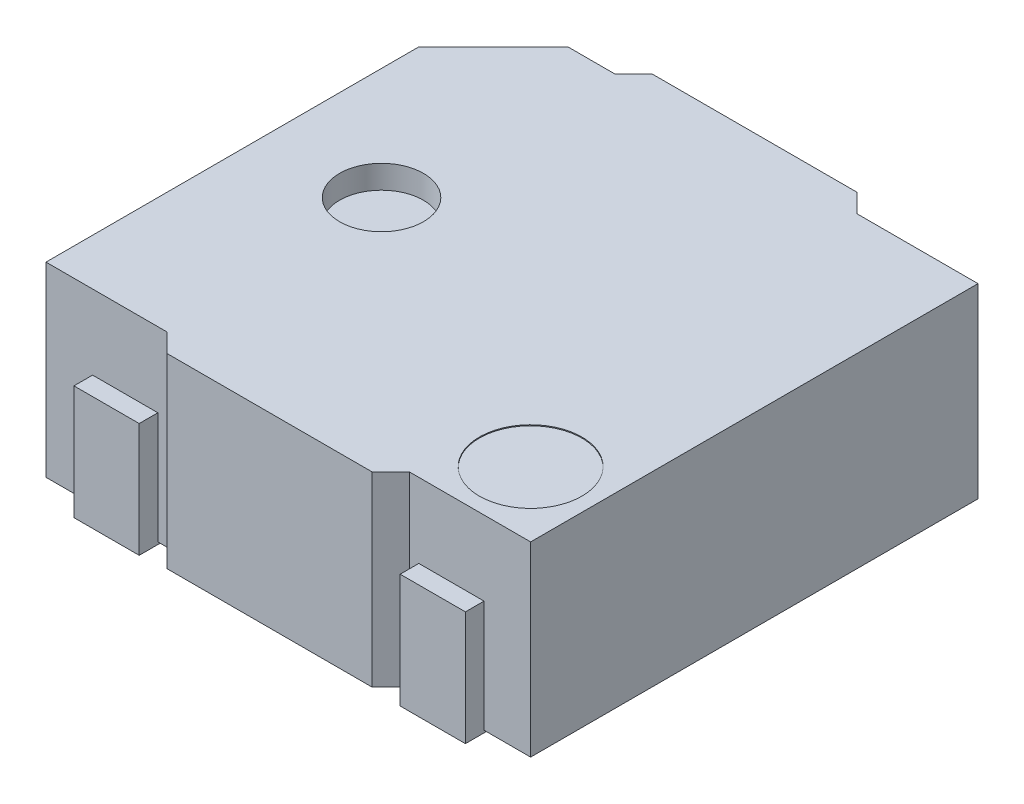
ISO-10303-21;
HEADER;
FILE_DESCRIPTION(('STEP AP214'),'2;1');
FILE_NAME('part.step','',(''),(''),'','','');
FILE_SCHEMA(('AUTOMOTIVE_DESIGN { 1 0 10303 214 1 1 1 1 }'));
ENDSEC;
DATA;
#1=APPLICATION_CONTEXT('core data for automotive mechanical design processes');
#2=APPLICATION_PROTOCOL_DEFINITION('international standard','automotive_design',2000,#1);
#3=PRODUCT_CONTEXT('',#1,'mechanical');
#4=PRODUCT('Part','Part','',(#3));
#5=PRODUCT_RELATED_PRODUCT_CATEGORY('part','',(#4));
#6=PRODUCT_DEFINITION_FORMATION('','',#4);
#7=PRODUCT_DEFINITION_CONTEXT('part definition',#1,'design');
#8=PRODUCT_DEFINITION('design','',#6,#7);
#9=PRODUCT_DEFINITION_SHAPE('','',#8);
#10=(LENGTH_UNIT() NAMED_UNIT(*) SI_UNIT(.MILLI.,.METRE.));
#11=(NAMED_UNIT(*) PLANE_ANGLE_UNIT() SI_UNIT($,.RADIAN.));
#12=(NAMED_UNIT(*) SI_UNIT($,.STERADIAN.) SOLID_ANGLE_UNIT());
#13=UNCERTAINTY_MEASURE_WITH_UNIT(LENGTH_MEASURE(1.E-05),#10,'distance_accuracy_value','');
#14=(GEOMETRIC_REPRESENTATION_CONTEXT(3) GLOBAL_UNCERTAINTY_ASSIGNED_CONTEXT((#13)) GLOBAL_UNIT_ASSIGNED_CONTEXT((#10,
#11,#12)) REPRESENTATION_CONTEXT('',''));
#15=CARTESIAN_POINT('',(0.,0.,0.));
#16=DIRECTION('',(0.,0.,1.));
#17=DIRECTION('',(1.,0.,0.));
#18=AXIS2_PLACEMENT_3D('',#15,#16,#17);
#19=CARTESIAN_POINT('',(2.6,2.025,2.60000000000001));
#20=DIRECTION('',(-1.,0.,0.));
#21=DIRECTION('',(0.,0.,1.));
#22=AXIS2_PLACEMENT_3D('',#19,#20,#21);
#23=PLANE('',#22);
#24=DIRECTION('',(0.,0.,-1.));
#25=VECTOR('',#24,1.);
#26=CARTESIAN_POINT('',(2.6,2.025,2.60000000000001));
#27=LINE('',#26,#25);
#28=CARTESIAN_POINT('',(2.6,2.025,2.40000000000001));
#29=VERTEX_POINT('',#28);
#30=CARTESIAN_POINT('',(2.6,2.025,-2.40000000000001));
#31=VERTEX_POINT('',#30);
#32=EDGE_CURVE('E441',#29,#31,#27,.T.);
#33=ORIENTED_EDGE('',*,*,#32,.F.);
#34=DIRECTION('',(0.,1.,0.));
#35=VECTOR('',#34,1.);
#36=CARTESIAN_POINT('',(2.6,0.0249999999999998,2.40000000000001));
#37=LINE('',#36,#35);
#38=CARTESIAN_POINT('',(2.6,0.0249999999999998,2.40000000000001));
#39=VERTEX_POINT('',#38);
#40=EDGE_CURVE('E362',#39,#29,#37,.T.);
#41=ORIENTED_EDGE('',*,*,#40,.F.);
#42=DIRECTION('',(0.,0.,-1.));
#43=VECTOR('',#42,1.);
#44=CARTESIAN_POINT('',(2.6,0.025,2.60000000000001));
#45=LINE('',#44,#43);
#46=CARTESIAN_POINT('',(2.6,0.0249999999999998,-2.40000000000001));
#47=VERTEX_POINT('',#46);
#48=EDGE_CURVE('E440',#39,#47,#45,.T.);
#49=ORIENTED_EDGE('',*,*,#48,.T.);
#50=DIRECTION('',(0.,1.,0.));
#51=VECTOR('',#50,1.);
#52=CARTESIAN_POINT('',(2.6,0.0249999999999998,-2.40000000000001));
#53=LINE('',#52,#51);
#54=EDGE_CURVE('E367',#47,#31,#53,.T.);
#55=ORIENTED_EDGE('',*,*,#54,.T.);
#56=EDGE_LOOP('',(#33,#41,#49,#55));
#57=FACE_BOUND('',#56,.T.);
#58=ADVANCED_FACE('F35',(#57),#23,.F.);
#59=CARTESIAN_POINT('',(-2.6,2.025,-2.60000000000002));
#60=DIRECTION('',(0.,0.,1.));
#61=DIRECTION('',(1.,0.,0.));
#62=AXIS2_PLACEMENT_3D('',#59,#60,#61);
#63=PLANE('',#62);
#64=DIRECTION('',(-1.,0.,0.));
#65=VECTOR('',#64,1.);
#66=CARTESIAN_POINT('',(-2.6,2.025,-2.60000000000002));
#67=LINE('',#66,#65);
#68=CARTESIAN_POINT('',(1.1,2.025,-2.60000000000001));
#69=VERTEX_POINT('',#68);
#70=CARTESIAN_POINT('',(-1.1,2.025,-2.60000000000001));
#71=VERTEX_POINT('',#70);
#72=EDGE_CURVE('E444',#69,#71,#67,.T.);
#73=ORIENTED_EDGE('',*,*,#72,.F.);
#74=DIRECTION('',(0.,1.,0.));
#75=VECTOR('',#74,1.);
#76=CARTESIAN_POINT('',(1.1,0.0249999999999998,-2.60000000000001));
#77=LINE('',#76,#75);
#78=CARTESIAN_POINT('',(1.1,0.0249999999999998,-2.60000000000001));
#79=VERTEX_POINT('',#78);
#80=EDGE_CURVE('E414',#79,#69,#77,.T.);
#81=ORIENTED_EDGE('',*,*,#80,.F.);
#82=DIRECTION('',(-1.,0.,0.));
#83=VECTOR('',#82,1.);
#84=CARTESIAN_POINT('',(-2.6,0.025,-2.60000000000002));
#85=LINE('',#84,#83);
#86=CARTESIAN_POINT('',(-1.1,0.0249999999999998,-2.60000000000001));
#87=VERTEX_POINT('',#86);
#88=EDGE_CURVE('E457',#79,#87,#85,.T.);
#89=ORIENTED_EDGE('',*,*,#88,.T.);
#90=DIRECTION('',(0.,1.,0.));
#91=VECTOR('',#90,1.);
#92=CARTESIAN_POINT('',(-1.1,0.0249999999999998,-2.60000000000001));
#93=LINE('',#92,#91);
#94=EDGE_CURVE('E416',#87,#71,#93,.T.);
#95=ORIENTED_EDGE('',*,*,#94,.T.);
#96=EDGE_LOOP('',(#73,#81,#89,#95));
#97=FACE_BOUND('',#96,.T.);
#98=ADVANCED_FACE('F508',(#97),#63,.F.);
#99=CARTESIAN_POINT('',(-2.6,2.025,2.60000000000001));
#100=DIRECTION('',(1.,0.,0.));
#101=DIRECTION('',(0.,0.,-1.));
#102=AXIS2_PLACEMENT_3D('',#99,#100,#101);
#103=PLANE('',#102);
#104=DIRECTION('',(0.,0.,1.));
#105=VECTOR('',#104,1.);
#106=CARTESIAN_POINT('',(-2.6,0.025,2.60000000000001));
#107=LINE('',#106,#105);
#108=CARTESIAN_POINT('',(-2.6,0.0249999999999998,-1.60000000000002));
#109=VERTEX_POINT('',#108);
#110=CARTESIAN_POINT('',(-2.6,0.0249999999999998,2.40000000000001));
#111=VERTEX_POINT('',#110);
#112=EDGE_CURVE('E460',#109,#111,#107,.T.);
#113=ORIENTED_EDGE('',*,*,#112,.T.);
#114=DIRECTION('',(0.,1.,0.));
#115=VECTOR('',#114,1.);
#116=CARTESIAN_POINT('',(-2.6,0.0249999999999998,2.40000000000001));
#117=LINE('',#116,#115);
#118=CARTESIAN_POINT('',(-2.6,2.025,2.40000000000001));
#119=VERTEX_POINT('',#118);
#120=EDGE_CURVE('E374',#111,#119,#117,.T.);
#121=ORIENTED_EDGE('',*,*,#120,.T.);
#122=DIRECTION('',(0.,0.,1.));
#123=VECTOR('',#122,1.);
#124=CARTESIAN_POINT('',(-2.6,2.025,2.60000000000001));
#125=LINE('',#124,#123);
#126=CARTESIAN_POINT('',(-2.6,2.025,-1.60000000000002));
#127=VERTEX_POINT('',#126);
#128=EDGE_CURVE('E448',#127,#119,#125,.T.);
#129=ORIENTED_EDGE('',*,*,#128,.F.);
#130=DIRECTION('',(0.,1.,0.));
#131=VECTOR('',#130,1.);
#132=CARTESIAN_POINT('',(-2.6,0.0249999999999998,-1.60000000000002));
#133=LINE('',#132,#131);
#134=EDGE_CURVE('E436',#109,#127,#133,.T.);
#135=ORIENTED_EDGE('',*,*,#134,.F.);
#136=EDGE_LOOP('',(#113,#121,#129,#135));
#137=FACE_BOUND('',#136,.T.);
#138=ADVANCED_FACE('F545',(#137),#103,.F.);
#139=CARTESIAN_POINT('',(-2.6,2.025,2.60000000000001));
#140=DIRECTION('',(0.,0.,-1.));
#141=DIRECTION('',(-1.,0.,0.));
#142=AXIS2_PLACEMENT_3D('',#139,#140,#141);
#143=PLANE('',#142);
#144=DIRECTION('',(1.,0.,0.));
#145=VECTOR('',#144,1.);
#146=CARTESIAN_POINT('',(-2.6,2.025,2.60000000000001));
#147=LINE('',#146,#145);
#148=CARTESIAN_POINT('',(-1.1,2.025,2.60000000000001));
#149=VERTEX_POINT('',#148);
#150=CARTESIAN_POINT('',(1.1,2.025,2.60000000000001));
#151=VERTEX_POINT('',#150);
#152=EDGE_CURVE('E451',#149,#151,#147,.T.);
#153=ORIENTED_EDGE('',*,*,#152,.F.);
#154=DIRECTION('',(0.,1.,0.));
#155=VECTOR('',#154,1.);
#156=CARTESIAN_POINT('',(-1.1,0.0249999999999998,2.60000000000001));
#157=LINE('',#156,#155);
#158=CARTESIAN_POINT('',(-1.1,0.0249999999999998,2.60000000000001));
#159=VERTEX_POINT('',#158);
#160=EDGE_CURVE('E380',#159,#149,#157,.T.);
#161=ORIENTED_EDGE('',*,*,#160,.F.);
#162=DIRECTION('',(1.,0.,0.));
#163=VECTOR('',#162,1.);
#164=CARTESIAN_POINT('',(-2.6,0.025,2.60000000000001));
#165=LINE('',#164,#163);
#166=CARTESIAN_POINT('',(1.1,0.0249999999999998,2.60000000000001));
#167=VERTEX_POINT('',#166);
#168=EDGE_CURVE('E445',#159,#167,#165,.T.);
#169=ORIENTED_EDGE('',*,*,#168,.T.);
#170=DIRECTION('',(0.,1.,0.));
#171=VECTOR('',#170,1.);
#172=CARTESIAN_POINT('',(1.1,0.0249999999999998,2.60000000000001));
#173=LINE('',#172,#171);
#174=EDGE_CURVE('E382',#167,#151,#173,.T.);
#175=ORIENTED_EDGE('',*,*,#174,.T.);
#176=EDGE_LOOP('',(#153,#161,#169,#175));
#177=FACE_BOUND('',#176,.T.);
#178=ADVANCED_FACE('F549',(#177),#143,.F.);
#179=CARTESIAN_POINT('',(0.,2.025,0.));
#180=DIRECTION('',(0.,-1.,0.));
#181=DIRECTION('',(0.,0.,-1.));
#182=AXIS2_PLACEMENT_3D('',#179,#180,#181);
#183=PLANE('',#182);
#184=CARTESIAN_POINT('',(1.90000000000001,2.025,1.70000000000001));
#185=DIRECTION('',(0.,1.,0.));
#186=DIRECTION('',(0.,0.,1.));
#187=AXIS2_PLACEMENT_3D('',#184,#185,#186);
#188=CIRCLE('',#187,0.550000000000001);
#189=CARTESIAN_POINT('',(1.90000000000001,2.025,2.25000000000001));
#190=VERTEX_POINT('',#189);
#191=EDGE_CURVE('E262',#190,#190,#188,.T.);
#192=ORIENTED_EDGE('',*,*,#191,.F.);
#193=EDGE_LOOP('',(#192));
#194=FACE_BOUND('',#193,.T.);
#195=CARTESIAN_POINT('',(-1.4,2.025,0.));
#196=DIRECTION('',(0.,1.,0.));
#197=DIRECTION('',(0.,0.,1.));
#198=AXIS2_PLACEMENT_3D('',#195,#196,#197);
#199=CIRCLE('',#198,0.45);
#200=CARTESIAN_POINT('',(-1.4,2.025,0.45));
#201=VERTEX_POINT('',#200);
#202=EDGE_CURVE('E429',#201,#201,#199,.T.);
#203=ORIENTED_EDGE('',*,*,#202,.F.);
#204=EDGE_LOOP('',(#203));
#205=FACE_BOUND('',#204,.T.);
#206=ORIENTED_EDGE('',*,*,#128,.T.);
#207=DIRECTION('',(-1.,0.,0.));
#208=VECTOR('',#207,1.);
#209=CARTESIAN_POINT('',(-2.6,2.025,2.40000000000001));
#210=LINE('',#209,#208);
#211=CARTESIAN_POINT('',(-1.3,2.025,2.40000000000001));
#212=VERTEX_POINT('',#211);
#213=EDGE_CURVE('E372',#212,#119,#210,.T.);
#214=ORIENTED_EDGE('',*,*,#213,.F.);
#215=DIRECTION('',(-0.707106781186546,0.,-0.707106781186549));
#216=VECTOR('',#215,1.);
#217=CARTESIAN_POINT('',(-1.3,2.025,2.40000000000001));
#218=LINE('',#217,#216);
#219=EDGE_CURVE('E369',#149,#212,#218,.T.);
#220=ORIENTED_EDGE('',*,*,#219,.F.);
#221=ORIENTED_EDGE('',*,*,#152,.T.);
#222=DIRECTION('',(-0.707106781186548,0.,0.707106781186547));
#223=VECTOR('',#222,1.);
#224=CARTESIAN_POINT('',(1.1,2.025,2.60000000000001));
#225=LINE('',#224,#223);
#226=CARTESIAN_POINT('',(1.3,2.025,2.40000000000001));
#227=VERTEX_POINT('',#226);
#228=EDGE_CURVE('E366',#227,#151,#225,.T.);
#229=ORIENTED_EDGE('',*,*,#228,.F.);
#230=DIRECTION('',(-1.,0.,0.));
#231=VECTOR('',#230,1.);
#232=CARTESIAN_POINT('',(1.3,2.025,2.40000000000001));
#233=LINE('',#232,#231);
#234=EDGE_CURVE('E363',#29,#227,#233,.T.);
#235=ORIENTED_EDGE('',*,*,#234,.F.);
#236=ORIENTED_EDGE('',*,*,#32,.T.);
#237=DIRECTION('',(1.,0.,0.));
#238=VECTOR('',#237,1.);
#239=CARTESIAN_POINT('',(1.3,2.025,-2.40000000000001));
#240=LINE('',#239,#238);
#241=CARTESIAN_POINT('',(1.3,2.025,-2.40000000000001));
#242=VERTEX_POINT('',#241);
#243=EDGE_CURVE('E392',#242,#31,#240,.T.);
#244=ORIENTED_EDGE('',*,*,#243,.F.);
#245=DIRECTION('',(0.707106781186548,0.,0.707106781186547));
#246=VECTOR('',#245,1.);
#247=CARTESIAN_POINT('',(1.1,2.025,-2.60000000000001));
#248=LINE('',#247,#246);
#249=EDGE_CURVE('E406',#69,#242,#248,.T.);
#250=ORIENTED_EDGE('',*,*,#249,.F.);
#251=ORIENTED_EDGE('',*,*,#72,.T.);
#252=DIRECTION('',(0.707106781186546,0.,-0.707106781186549));
#253=VECTOR('',#252,1.);
#254=CARTESIAN_POINT('',(-1.3,2.025,-2.40000000000001));
#255=LINE('',#254,#253);
#256=CARTESIAN_POINT('',(-1.3,2.025,-2.40000000000001));
#257=VERTEX_POINT('',#256);
#258=EDGE_CURVE('E404',#257,#71,#255,.T.);
#259=ORIENTED_EDGE('',*,*,#258,.F.);
#260=DIRECTION('',(1.,0.,0.));
#261=VECTOR('',#260,1.);
#262=CARTESIAN_POINT('',(-2.6,2.025,-2.40000000000001));
#263=LINE('',#262,#261);
#264=CARTESIAN_POINT('',(-1.80000000000001,2.025,-2.40000000000001));
#265=VERTEX_POINT('',#264);
#266=EDGE_CURVE('E347',#265,#257,#263,.T.);
#267=ORIENTED_EDGE('',*,*,#266,.F.);
#268=DIRECTION('',(0.707106781186549,0.,-0.707106781186546));
#269=VECTOR('',#268,1.);
#270=CARTESIAN_POINT('',(-2.6,2.025,-1.60000000000002));
#271=LINE('',#270,#269);
#272=EDGE_CURVE('E432',#127,#265,#271,.T.);
#273=ORIENTED_EDGE('',*,*,#272,.F.);
#274=EDGE_LOOP('',(#206,#214,#220,#221,#229,#235,#236,#244,#250,#251,#259,#267,#273));
#275=FACE_BOUND('',#274,.T.);
#276=ADVANCED_FACE('F511',(#194,#205,#275),#183,.F.);
#277=CARTESIAN_POINT('',(0.,0.025,0.));
#278=DIRECTION('',(0.,-1.,0.));
#279=DIRECTION('',(0.,0.,-1.));
#280=AXIS2_PLACEMENT_3D('',#277,#278,#279);
#281=PLANE('',#280);
#282=DIRECTION('',(0.,0.,-1.));
#283=VECTOR('',#282,1.);
#284=CARTESIAN_POINT('',(1.4,0.025,0.));
#285=LINE('',#284,#283);
#286=CARTESIAN_POINT('',(1.4,0.0250000000000001,-1.70000000000001));
#287=VERTEX_POINT('',#286);
#288=CARTESIAN_POINT('',(1.4,0.0249999999999998,-2.40000000000001));
#289=VERTEX_POINT('',#288);
#290=EDGE_CURVE('E280',#287,#289,#285,.T.);
#291=ORIENTED_EDGE('',*,*,#290,.F.);
#292=DIRECTION('',(-1.,0.,0.));
#293=VECTOR('',#292,1.);
#294=CARTESIAN_POINT('',(0.,0.025,-1.70000000000001));
#295=LINE('',#294,#293);
#296=CARTESIAN_POINT('',(2.1,0.0250000000000001,-1.70000000000001));
#297=VERTEX_POINT('',#296);
#298=EDGE_CURVE('E11',#297,#287,#295,.T.);
#299=ORIENTED_EDGE('',*,*,#298,.F.);
#300=DIRECTION('',(0.,0.,1.));
#301=VECTOR('',#300,1.);
#302=CARTESIAN_POINT('',(2.1,0.025,0.));
#303=LINE('',#302,#301);
#304=CARTESIAN_POINT('',(2.1,0.0249999999999998,-2.40000000000001));
#305=VERTEX_POINT('',#304);
#306=EDGE_CURVE('E275',#305,#297,#303,.T.);
#307=ORIENTED_EDGE('',*,*,#306,.F.);
#308=DIRECTION('',(1.,0.,0.));
#309=VECTOR('',#308,1.);
#310=CARTESIAN_POINT('',(1.3,0.0249999999999998,-2.40000000000001));
#311=LINE('',#310,#309);
#312=EDGE_CURVE('E398',#305,#47,#311,.T.);
#313=ORIENTED_EDGE('',*,*,#312,.T.);
#314=ORIENTED_EDGE('',*,*,#48,.F.);
#315=DIRECTION('',(-1.,0.,0.));
#316=VECTOR('',#315,1.);
#317=CARTESIAN_POINT('',(1.3,0.0249999999999998,2.40000000000001));
#318=LINE('',#317,#316);
#319=CARTESIAN_POINT('',(2.1,0.0249999999999998,2.40000000000001));
#320=VERTEX_POINT('',#319);
#321=EDGE_CURVE('E348',#39,#320,#318,.T.);
#322=ORIENTED_EDGE('',*,*,#321,.T.);
#323=DIRECTION('',(0.,0.,1.));
#324=VECTOR('',#323,1.);
#325=CARTESIAN_POINT('',(2.1,0.025,0.));
#326=LINE('',#325,#324);
#327=CARTESIAN_POINT('',(2.1,0.025,1.70000000000001));
#328=VERTEX_POINT('',#327);
#329=EDGE_CURVE('E336',#328,#320,#326,.T.);
#330=ORIENTED_EDGE('',*,*,#329,.F.);
#331=DIRECTION('',(1.,0.,0.));
#332=VECTOR('',#331,1.);
#333=CARTESIAN_POINT('',(0.,0.025,1.70000000000001));
#334=LINE('',#333,#332);
#335=CARTESIAN_POINT('',(1.4,0.025,1.70000000000001));
#336=VERTEX_POINT('',#335);
#337=EDGE_CURVE('E474',#336,#328,#334,.T.);
#338=ORIENTED_EDGE('',*,*,#337,.F.);
#339=DIRECTION('',(0.,0.,-1.));
#340=VECTOR('',#339,1.);
#341=CARTESIAN_POINT('',(1.4,0.025,0.));
#342=LINE('',#341,#340);
#343=CARTESIAN_POINT('',(1.4,0.0249999999999998,2.40000000000001));
#344=VERTEX_POINT('',#343);
#345=EDGE_CURVE('E344',#344,#336,#342,.T.);
#346=ORIENTED_EDGE('',*,*,#345,.F.);
#347=CARTESIAN_POINT('',(1.3,0.025,2.40000000000001));
#348=VERTEX_POINT('',#347);
#349=EDGE_CURVE('E352',#344,#348,#318,.T.);
#350=ORIENTED_EDGE('',*,*,#349,.T.);
#351=DIRECTION('',(-0.707106781186548,0.,0.707106781186547));
#352=VECTOR('',#351,1.);
#353=CARTESIAN_POINT('',(1.1,0.0249999999999998,2.60000000000001));
#354=LINE('',#353,#352);
#355=EDGE_CURVE('E351',#348,#167,#354,.T.);
#356=ORIENTED_EDGE('',*,*,#355,.T.);
#357=ORIENTED_EDGE('',*,*,#168,.F.);
#358=DIRECTION('',(-0.707106781186546,0.,-0.707106781186549));
#359=VECTOR('',#358,1.);
#360=CARTESIAN_POINT('',(-1.3,0.0249999999999998,2.40000000000001));
#361=LINE('',#360,#359);
#362=CARTESIAN_POINT('',(-1.3,0.025,2.40000000000001));
#363=VERTEX_POINT('',#362);
#364=EDGE_CURVE('E355',#159,#363,#361,.T.);
#365=ORIENTED_EDGE('',*,*,#364,.T.);
#366=DIRECTION('',(-1.,0.,0.));
#367=VECTOR('',#366,1.);
#368=CARTESIAN_POINT('',(-2.6,0.0249999999999998,2.40000000000001));
#369=LINE('',#368,#367);
#370=CARTESIAN_POINT('',(-1.4,0.0249999999999998,2.40000000000001));
#371=VERTEX_POINT('',#370);
#372=EDGE_CURVE('E359',#363,#371,#369,.T.);
#373=ORIENTED_EDGE('',*,*,#372,.T.);
#374=DIRECTION('',(0.,0.,1.));
#375=VECTOR('',#374,1.);
#376=CARTESIAN_POINT('',(-1.4,0.025,0.));
#377=LINE('',#376,#375);
#378=CARTESIAN_POINT('',(-1.4,0.0250000000000001,1.70000000000001));
#379=VERTEX_POINT('',#378);
#380=EDGE_CURVE('E311',#379,#371,#377,.T.);
#381=ORIENTED_EDGE('',*,*,#380,.F.);
#382=DIRECTION('',(1.,0.,0.));
#383=VECTOR('',#382,1.);
#384=CARTESIAN_POINT('',(0.,0.025,1.70000000000001));
#385=LINE('',#384,#383);
#386=CARTESIAN_POINT('',(-2.1,0.0250000000000001,1.70000000000001));
#387=VERTEX_POINT('',#386);
#388=EDGE_CURVE('E486',#387,#379,#385,.T.);
#389=ORIENTED_EDGE('',*,*,#388,.F.);
#390=DIRECTION('',(0.,0.,-1.));
#391=VECTOR('',#390,1.);
#392=CARTESIAN_POINT('',(-2.1,0.025,0.));
#393=LINE('',#392,#391);
#394=CARTESIAN_POINT('',(-2.1,0.0249999999999998,2.40000000000001));
#395=VERTEX_POINT('',#394);
#396=EDGE_CURVE('E304',#395,#387,#393,.T.);
#397=ORIENTED_EDGE('',*,*,#396,.F.);
#398=EDGE_CURVE('E358',#395,#111,#369,.T.);
#399=ORIENTED_EDGE('',*,*,#398,.T.);
#400=ORIENTED_EDGE('',*,*,#112,.F.);
#401=DIRECTION('',(0.707106781186549,0.,-0.707106781186546));
#402=VECTOR('',#401,1.);
#403=CARTESIAN_POINT('',(-2.6,0.0249999999999998,-1.60000000000002));
#404=LINE('',#403,#402);
#405=CARTESIAN_POINT('',(-1.80000000000001,0.0249999999999998,-2.40000000000001));
#406=VERTEX_POINT('',#405);
#407=EDGE_CURVE('E433',#109,#406,#404,.T.);
#408=ORIENTED_EDGE('',*,*,#407,.T.);
#409=DIRECTION('',(1.,0.,0.));
#410=VECTOR('',#409,1.);
#411=CARTESIAN_POINT('',(-2.6,0.0249999999999998,-2.40000000000001));
#412=LINE('',#411,#410);
#413=CARTESIAN_POINT('',(-1.3,0.0249999999999998,-2.40000000000001));
#414=VERTEX_POINT('',#413);
#415=EDGE_CURVE('E388',#406,#414,#412,.T.);
#416=ORIENTED_EDGE('',*,*,#415,.T.);
#417=DIRECTION('',(0.707106781186546,0.,-0.707106781186549));
#418=VECTOR('',#417,1.);
#419=CARTESIAN_POINT('',(-1.3,0.0249999999999998,-2.40000000000001));
#420=LINE('',#419,#418);
#421=EDGE_CURVE('E391',#414,#87,#420,.T.);
#422=ORIENTED_EDGE('',*,*,#421,.T.);
#423=ORIENTED_EDGE('',*,*,#88,.F.);
#424=DIRECTION('',(0.707106781186548,0.,0.707106781186547));
#425=VECTOR('',#424,1.);
#426=CARTESIAN_POINT('',(1.1,0.0249999999999998,-2.60000000000001));
#427=LINE('',#426,#425);
#428=CARTESIAN_POINT('',(1.3,0.025,-2.40000000000001));
#429=VERTEX_POINT('',#428);
#430=EDGE_CURVE('E395',#79,#429,#427,.T.);
#431=ORIENTED_EDGE('',*,*,#430,.T.);
#432=EDGE_CURVE('E399',#429,#289,#311,.T.);
#433=ORIENTED_EDGE('',*,*,#432,.T.);
#434=EDGE_LOOP('',(#291,#299,#307,#313,#314,#322,#330,#338,#346,#350,#356,#357,#365,#373,#381,
#389,#397,#399,#400,#408,#416,#422,#423,#431,#433));
#435=FACE_BOUND('',#434,.T.);
#436=ADVANCED_FACE('F499',(#435),#281,.T.);
#437=CARTESIAN_POINT('',(-2.6,0.0249999999999998,-1.60000000000002));
#438=DIRECTION('',(0.707106781186546,0.,0.707106781186549));
#439=DIRECTION('',(0.707106781186549,0.,-0.707106781186546));
#440=AXIS2_PLACEMENT_3D('',#437,#438,#439);
#441=PLANE('',#440);
#442=ORIENTED_EDGE('',*,*,#272,.T.);
#443=DIRECTION('',(0.,-1.,0.));
#444=VECTOR('',#443,1.);
#445=CARTESIAN_POINT('',(-1.80000000000001,0.0249999999999998,-2.40000000000001));
#446=LINE('',#445,#444);
#447=EDGE_CURVE('E454',#265,#406,#446,.T.);
#448=ORIENTED_EDGE('',*,*,#447,.T.);
#449=ORIENTED_EDGE('',*,*,#407,.F.);
#450=ORIENTED_EDGE('',*,*,#134,.T.);
#451=EDGE_LOOP('',(#442,#448,#449,#450));
#452=FACE_BOUND('',#451,.T.);
#453=ADVANCED_FACE('F558',(#452),#441,.F.);
#454=CARTESIAN_POINT('',(-1.4,1.775,0.));
#455=DIRECTION('',(0.,1.,0.));
#456=DIRECTION('',(0.,0.,1.));
#457=AXIS2_PLACEMENT_3D('',#454,#455,#456);
#458=CYLINDRICAL_SURFACE('',#457,0.45);
#459=CARTESIAN_POINT('',(-1.4,1.775,0.));
#460=DIRECTION('',(0.,1.,0.));
#461=DIRECTION('',(0.,0.,1.));
#462=AXIS2_PLACEMENT_3D('',#459,#460,#461);
#463=CIRCLE('',#462,0.45);
#464=CARTESIAN_POINT('',(-1.4,1.775,0.45));
#465=VERTEX_POINT('',#464);
#466=EDGE_CURVE('E424',#465,#465,#463,.T.);
#467=ORIENTED_EDGE('',*,*,#466,.F.);
#468=EDGE_LOOP('',(#467));
#469=FACE_BOUND('',#468,.T.);
#470=ORIENTED_EDGE('',*,*,#202,.T.);
#471=EDGE_LOOP('',(#470));
#472=FACE_BOUND('',#471,.T.);
#473=ADVANCED_FACE('F564',(#469,#472),#458,.F.);
#474=CARTESIAN_POINT('',(-1.4,1.575,0.));
#475=DIRECTION('',(0.,1.,0.));
#476=DIRECTION('',(0.,0.,1.));
#477=AXIS2_PLACEMENT_3D('',#474,#475,#476);
#478=CYLINDRICAL_SURFACE('',#477,0.8);
#479=CARTESIAN_POINT('',(-1.4,1.575,0.));
#480=DIRECTION('',(0.,1.,0.));
#481=DIRECTION('',(0.,0.,1.));
#482=AXIS2_PLACEMENT_3D('',#479,#480,#481);
#483=CIRCLE('',#482,0.8);
#484=CARTESIAN_POINT('',(-1.4,1.575,0.8));
#485=VERTEX_POINT('',#484);
#486=EDGE_CURVE('E421',#485,#485,#483,.T.);
#487=ORIENTED_EDGE('',*,*,#486,.F.);
#488=EDGE_LOOP('',(#487));
#489=FACE_BOUND('',#488,.T.);
#490=CARTESIAN_POINT('',(-1.4,1.775,0.));
#491=DIRECTION('',(0.,1.,0.));
#492=DIRECTION('',(0.,0.,1.));
#493=AXIS2_PLACEMENT_3D('',#490,#491,#492);
#494=CIRCLE('',#493,0.8);
#495=CARTESIAN_POINT('',(-1.4,1.775,0.8));
#496=VERTEX_POINT('',#495);
#497=EDGE_CURVE('E377',#496,#496,#494,.T.);
#498=ORIENTED_EDGE('',*,*,#497,.T.);
#499=EDGE_LOOP('',(#498));
#500=FACE_BOUND('',#499,.T.);
#501=ADVANCED_FACE('F568',(#489,#500),#478,.F.);
#502=CARTESIAN_POINT('',(-1.4,1.575,0.));
#503=DIRECTION('',(0.,1.,0.));
#504=DIRECTION('',(0.,0.,1.));
#505=AXIS2_PLACEMENT_3D('',#502,#503,#504);
#506=PLANE('',#505);
#507=ORIENTED_EDGE('',*,*,#486,.T.);
#508=EDGE_LOOP('',(#507));
#509=FACE_BOUND('',#508,.T.);
#510=ADVANCED_FACE('F572',(#509),#506,.T.);
#511=CARTESIAN_POINT('',(-1.4,1.775,0.));
#512=DIRECTION('',(0.,1.,0.));
#513=DIRECTION('',(0.,0.,1.));
#514=AXIS2_PLACEMENT_3D('',#511,#512,#513);
#515=PLANE('',#514);
#516=ORIENTED_EDGE('',*,*,#466,.T.);
#517=EDGE_LOOP('',(#516));
#518=FACE_BOUND('',#517,.T.);
#519=ORIENTED_EDGE('',*,*,#497,.F.);
#520=EDGE_LOOP('',(#519));
#521=FACE_BOUND('',#520,.T.);
#522=ADVANCED_FACE('F574',(#518,#521),#515,.F.);
#523=CARTESIAN_POINT('',(-2.6,0.0249999999999998,-2.40000000000001));
#524=DIRECTION('',(0.,0.,1.));
#525=DIRECTION('',(1.,0.,0.));
#526=AXIS2_PLACEMENT_3D('',#523,#524,#525);
#527=PLANE('',#526);
#528=ORIENTED_EDGE('',*,*,#266,.T.);
#529=DIRECTION('',(0.,1.,0.));
#530=VECTOR('',#529,1.);
#531=CARTESIAN_POINT('',(-1.3,0.0249999999999998,-2.40000000000001));
#532=LINE('',#531,#530);
#533=EDGE_CURVE('E402',#414,#257,#532,.T.);
#534=ORIENTED_EDGE('',*,*,#533,.F.);
#535=ORIENTED_EDGE('',*,*,#415,.F.);
#536=ORIENTED_EDGE('',*,*,#447,.F.);
#537=EDGE_LOOP('',(#528,#534,#535,#536));
#538=FACE_BOUND('',#537,.T.);
#539=ADVANCED_FACE('F577',(#538),#527,.F.);
#540=CARTESIAN_POINT('',(-1.3,0.0249999999999998,-2.40000000000001));
#541=DIRECTION('',(0.707106781186549,0.,0.707106781186546));
#542=DIRECTION('',(0.707106781186546,0.,-0.707106781186549));
#543=AXIS2_PLACEMENT_3D('',#540,#541,#542);
#544=PLANE('',#543);
#545=ORIENTED_EDGE('',*,*,#258,.T.);
#546=ORIENTED_EDGE('',*,*,#94,.F.);
#547=ORIENTED_EDGE('',*,*,#421,.F.);
#548=ORIENTED_EDGE('',*,*,#533,.T.);
#549=EDGE_LOOP('',(#545,#546,#547,#548));
#550=FACE_BOUND('',#549,.T.);
#551=ADVANCED_FACE('F584',(#550),#544,.F.);
#552=CARTESIAN_POINT('',(1.3,0.0249999999999998,-2.40000000000001));
#553=DIRECTION('',(0.,0.,1.));
#554=DIRECTION('',(1.,0.,0.));
#555=AXIS2_PLACEMENT_3D('',#552,#553,#554);
#556=PLANE('',#555);
#557=DIRECTION('',(-1.,0.,0.));
#558=VECTOR('',#557,1.);
#559=CARTESIAN_POINT('',(1.3,1.225,-2.40000000000001));
#560=LINE('',#559,#558);
#561=CARTESIAN_POINT('',(2.1,1.225,-2.40000000000001));
#562=VERTEX_POINT('',#561);
#563=CARTESIAN_POINT('',(1.4,1.225,-2.40000000000001));
#564=VERTEX_POINT('',#563);
#565=EDGE_CURVE('E488',#562,#564,#560,.T.);
#566=ORIENTED_EDGE('',*,*,#565,.T.);
#567=DIRECTION('',(0.,-1.,0.));
#568=VECTOR('',#567,1.);
#569=CARTESIAN_POINT('',(1.4,0.0249999999999998,-2.40000000000001));
#570=LINE('',#569,#568);
#571=EDGE_CURVE('E42',#564,#289,#570,.T.);
#572=ORIENTED_EDGE('',*,*,#571,.T.);
#573=ORIENTED_EDGE('',*,*,#432,.F.);
#574=DIRECTION('',(0.,1.,0.));
#575=VECTOR('',#574,1.);
#576=CARTESIAN_POINT('',(1.3,0.0249999999999998,-2.40000000000001));
#577=LINE('',#576,#575);
#578=EDGE_CURVE('E412',#429,#242,#577,.T.);
#579=ORIENTED_EDGE('',*,*,#578,.T.);
#580=ORIENTED_EDGE('',*,*,#243,.T.);
#581=ORIENTED_EDGE('',*,*,#54,.F.);
#582=ORIENTED_EDGE('',*,*,#312,.F.);
#583=DIRECTION('',(0.,1.,0.));
#584=VECTOR('',#583,1.);
#585=CARTESIAN_POINT('',(2.1,0.0249999999999998,-2.40000000000001));
#586=LINE('',#585,#584);
#587=EDGE_CURVE('E491',#305,#562,#586,.T.);
#588=ORIENTED_EDGE('',*,*,#587,.T.);
#589=EDGE_LOOP('',(#566,#572,#573,#579,#580,#581,#582,#588));
#590=FACE_BOUND('',#589,.T.);
#591=ADVANCED_FACE('F495',(#590),#556,.F.);
#592=CARTESIAN_POINT('',(1.1,0.0249999999999998,-2.60000000000001));
#593=DIRECTION('',(-0.707106781186547,0.,0.707106781186548));
#594=DIRECTION('',(0.707106781186548,0.,0.707106781186547));
#595=AXIS2_PLACEMENT_3D('',#592,#593,#594);
#596=PLANE('',#595);
#597=ORIENTED_EDGE('',*,*,#249,.T.);
#598=ORIENTED_EDGE('',*,*,#578,.F.);
#599=ORIENTED_EDGE('',*,*,#430,.F.);
#600=ORIENTED_EDGE('',*,*,#80,.T.);
#601=EDGE_LOOP('',(#597,#598,#599,#600));
#602=FACE_BOUND('',#601,.T.);
#603=ADVANCED_FACE('F504',(#602),#596,.F.);
#604=CARTESIAN_POINT('',(1.3,0.0249999999999998,2.40000000000001));
#605=DIRECTION('',(0.,0.,-1.));
#606=DIRECTION('',(-1.,0.,0.));
#607=AXIS2_PLACEMENT_3D('',#604,#605,#606);
#608=PLANE('',#607);
#609=ORIENTED_EDGE('',*,*,#349,.F.);
#610=DIRECTION('',(0.,1.,0.));
#611=VECTOR('',#610,1.);
#612=CARTESIAN_POINT('',(1.4,0.0249999999999998,2.40000000000001));
#613=LINE('',#612,#611);
#614=CARTESIAN_POINT('',(1.4,1.225,2.40000000000001));
#615=VERTEX_POINT('',#614);
#616=EDGE_CURVE('E472',#344,#615,#613,.T.);
#617=ORIENTED_EDGE('',*,*,#616,.T.);
#618=DIRECTION('',(-1.,0.,0.));
#619=VECTOR('',#618,1.);
#620=CARTESIAN_POINT('',(1.3,1.225,2.40000000000001));
#621=LINE('',#620,#619);
#622=CARTESIAN_POINT('',(2.1,1.225,2.40000000000001));
#623=VERTEX_POINT('',#622);
#624=EDGE_CURVE('E467',#623,#615,#621,.T.);
#625=ORIENTED_EDGE('',*,*,#624,.F.);
#626=DIRECTION('',(0.,-1.,0.));
#627=VECTOR('',#626,1.);
#628=CARTESIAN_POINT('',(2.1,0.0249999999999998,2.40000000000001));
#629=LINE('',#628,#627);
#630=EDGE_CURVE('E470',#623,#320,#629,.T.);
#631=ORIENTED_EDGE('',*,*,#630,.T.);
#632=ORIENTED_EDGE('',*,*,#321,.F.);
#633=ORIENTED_EDGE('',*,*,#40,.T.);
#634=ORIENTED_EDGE('',*,*,#234,.T.);
#635=DIRECTION('',(0.,1.,0.));
#636=VECTOR('',#635,1.);
#637=CARTESIAN_POINT('',(1.3,0.0249999999999998,2.40000000000001));
#638=LINE('',#637,#636);
#639=EDGE_CURVE('E385',#348,#227,#638,.T.);
#640=ORIENTED_EDGE('',*,*,#639,.F.);
#641=EDGE_LOOP('',(#609,#617,#625,#631,#632,#633,#634,#640));
#642=FACE_BOUND('',#641,.T.);
#643=ADVANCED_FACE('F591',(#642),#608,.F.);
#644=CARTESIAN_POINT('',(1.1,0.0249999999999998,2.60000000000001));
#645=DIRECTION('',(-0.707106781186547,0.,-0.707106781186548));
#646=DIRECTION('',(-0.707106781186548,0.,0.707106781186547));
#647=AXIS2_PLACEMENT_3D('',#644,#645,#646);
#648=PLANE('',#647);
#649=ORIENTED_EDGE('',*,*,#228,.T.);
#650=ORIENTED_EDGE('',*,*,#174,.F.);
#651=ORIENTED_EDGE('',*,*,#355,.F.);
#652=ORIENTED_EDGE('',*,*,#639,.T.);
#653=EDGE_LOOP('',(#649,#650,#651,#652));
#654=FACE_BOUND('',#653,.T.);
#655=ADVANCED_FACE('F596',(#654),#648,.F.);
#656=CARTESIAN_POINT('',(-2.6,0.0249999999999998,2.40000000000001));
#657=DIRECTION('',(0.,0.,-1.));
#658=DIRECTION('',(-1.,0.,0.));
#659=AXIS2_PLACEMENT_3D('',#656,#657,#658);
#660=PLANE('',#659);
#661=DIRECTION('',(1.,0.,0.));
#662=VECTOR('',#661,1.);
#663=CARTESIAN_POINT('',(-2.6,1.225,2.40000000000001));
#664=LINE('',#663,#662);
#665=CARTESIAN_POINT('',(-2.1,1.225,2.40000000000001));
#666=VERTEX_POINT('',#665);
#667=CARTESIAN_POINT('',(-1.4,1.225,2.40000000000001));
#668=VERTEX_POINT('',#667);
#669=EDGE_CURVE('E477',#666,#668,#664,.T.);
#670=ORIENTED_EDGE('',*,*,#669,.T.);
#671=DIRECTION('',(0.,-1.,0.));
#672=VECTOR('',#671,1.);
#673=CARTESIAN_POINT('',(-1.4,0.0249999999999998,2.40000000000001));
#674=LINE('',#673,#672);
#675=EDGE_CURVE('E483',#668,#371,#674,.T.);
#676=ORIENTED_EDGE('',*,*,#675,.T.);
#677=ORIENTED_EDGE('',*,*,#372,.F.);
#678=DIRECTION('',(0.,1.,0.));
#679=VECTOR('',#678,1.);
#680=CARTESIAN_POINT('',(-1.3,0.0249999999999998,2.40000000000001));
#681=LINE('',#680,#679);
#682=EDGE_CURVE('E378',#363,#212,#681,.T.);
#683=ORIENTED_EDGE('',*,*,#682,.T.);
#684=ORIENTED_EDGE('',*,*,#213,.T.);
#685=ORIENTED_EDGE('',*,*,#120,.F.);
#686=ORIENTED_EDGE('',*,*,#398,.F.);
#687=DIRECTION('',(0.,1.,0.));
#688=VECTOR('',#687,1.);
#689=CARTESIAN_POINT('',(-2.1,0.0249999999999998,2.40000000000001));
#690=LINE('',#689,#688);
#691=EDGE_CURVE('E480',#395,#666,#690,.T.);
#692=ORIENTED_EDGE('',*,*,#691,.T.);
#693=EDGE_LOOP('',(#670,#676,#677,#683,#684,#685,#686,#692));
#694=FACE_BOUND('',#693,.T.);
#695=ADVANCED_FACE('F600',(#694),#660,.F.);
#696=CARTESIAN_POINT('',(-1.3,0.0249999999999998,2.40000000000001));
#697=DIRECTION('',(0.707106781186549,0.,-0.707106781186546));
#698=DIRECTION('',(-0.707106781186546,0.,-0.707106781186549));
#699=AXIS2_PLACEMENT_3D('',#696,#697,#698);
#700=PLANE('',#699);
#701=ORIENTED_EDGE('',*,*,#219,.T.);
#702=ORIENTED_EDGE('',*,*,#682,.F.);
#703=ORIENTED_EDGE('',*,*,#364,.F.);
#704=ORIENTED_EDGE('',*,*,#160,.T.);
#705=EDGE_LOOP('',(#701,#702,#703,#704));
#706=FACE_BOUND('',#705,.T.);
#707=ADVANCED_FACE('F602',(#706),#700,.F.);
#708=CARTESIAN_POINT('',(0.,1.225,0.));
#709=DIRECTION('',(0.,-1.,0.));
#710=DIRECTION('',(0.,0.,-1.));
#711=AXIS2_PLACEMENT_3D('',#708,#709,#710);
#712=PLANE('',#711);
#713=DIRECTION('',(0.,0.,1.));
#714=VECTOR('',#713,1.);
#715=CARTESIAN_POINT('',(2.1,1.225,2.60000000000001));
#716=LINE('',#715,#714);
#717=CARTESIAN_POINT('',(2.1,1.225,2.60000000000001));
#718=VERTEX_POINT('',#717);
#719=EDGE_CURVE('E328',#623,#718,#716,.T.);
#720=ORIENTED_EDGE('',*,*,#719,.F.);
#721=ORIENTED_EDGE('',*,*,#624,.T.);
#722=DIRECTION('',(0.,0.,-1.));
#723=VECTOR('',#722,1.);
#724=CARTESIAN_POINT('',(1.4,1.225,2.60000000000001));
#725=LINE('',#724,#723);
#726=CARTESIAN_POINT('',(1.4,1.225,2.60000000000001));
#727=VERTEX_POINT('',#726);
#728=EDGE_CURVE('E325',#727,#615,#725,.T.);
#729=ORIENTED_EDGE('',*,*,#728,.F.);
#730=DIRECTION('',(-1.,0.,0.));
#731=VECTOR('',#730,1.);
#732=CARTESIAN_POINT('',(1.4,1.225,2.60000000000001));
#733=LINE('',#732,#731);
#734=EDGE_CURVE('E330',#718,#727,#733,.T.);
#735=ORIENTED_EDGE('',*,*,#734,.F.);
#736=EDGE_LOOP('',(#720,#721,#729,#735));
#737=FACE_BOUND('',#736,.T.);
#738=ADVANCED_FACE('F605',(#737),#712,.F.);
#739=CARTESIAN_POINT('',(1.4,1.225,2.60000000000001));
#740=DIRECTION('',(-1.,0.,0.));
#741=DIRECTION('',(0.,0.,1.));
#742=AXIS2_PLACEMENT_3D('',#739,#740,#741);
#743=PLANE('',#742);
#744=ORIENTED_EDGE('',*,*,#616,.F.);
#745=ORIENTED_EDGE('',*,*,#345,.T.);
#746=DIRECTION('',(0.,-1.,0.));
#747=VECTOR('',#746,1.);
#748=CARTESIAN_POINT('',(1.4,1.225,1.70000000000001));
#749=LINE('',#748,#747);
#750=CARTESIAN_POINT('',(1.4,0.,1.70000000000001));
#751=VERTEX_POINT('',#750);
#752=EDGE_CURVE('E333',#336,#751,#749,.T.);
#753=ORIENTED_EDGE('',*,*,#752,.T.);
#754=DIRECTION('',(0.,0.,-1.));
#755=VECTOR('',#754,1.);
#756=CARTESIAN_POINT('',(1.4,0.,2.60000000000001));
#757=LINE('',#756,#755);
#758=CARTESIAN_POINT('',(1.4,0.,2.60000000000001));
#759=VERTEX_POINT('',#758);
#760=EDGE_CURVE('E313',#759,#751,#757,.T.);
#761=ORIENTED_EDGE('',*,*,#760,.F.);
#762=DIRECTION('',(0.,-1.,0.));
#763=VECTOR('',#762,1.);
#764=CARTESIAN_POINT('',(1.4,1.225,2.60000000000001));
#765=LINE('',#764,#763);
#766=EDGE_CURVE('E334',#727,#759,#765,.T.);
#767=ORIENTED_EDGE('',*,*,#766,.F.);
#768=ORIENTED_EDGE('',*,*,#728,.T.);
#769=EDGE_LOOP('',(#744,#745,#753,#761,#767,#768));
#770=FACE_BOUND('',#769,.T.);
#771=ADVANCED_FACE('F610',(#770),#743,.T.);
#772=CARTESIAN_POINT('',(1.4,1.225,2.60000000000001));
#773=DIRECTION('',(0.,0.,1.));
#774=DIRECTION('',(1.,0.,0.));
#775=AXIS2_PLACEMENT_3D('',#772,#773,#774);
#776=PLANE('',#775);
#777=ORIENTED_EDGE('',*,*,#766,.T.);
#778=DIRECTION('',(-1.,0.,0.));
#779=VECTOR('',#778,1.);
#780=CARTESIAN_POINT('',(1.4,0.,2.60000000000001));
#781=LINE('',#780,#779);
#782=CARTESIAN_POINT('',(2.1,0.,2.60000000000001));
#783=VERTEX_POINT('',#782);
#784=EDGE_CURVE('E322',#783,#759,#781,.T.);
#785=ORIENTED_EDGE('',*,*,#784,.F.);
#786=DIRECTION('',(0.,-1.,0.));
#787=VECTOR('',#786,1.);
#788=CARTESIAN_POINT('',(2.1,1.225,2.60000000000001));
#789=LINE('',#788,#787);
#790=EDGE_CURVE('E337',#718,#783,#789,.T.);
#791=ORIENTED_EDGE('',*,*,#790,.F.);
#792=ORIENTED_EDGE('',*,*,#734,.T.);
#793=EDGE_LOOP('',(#777,#785,#791,#792));
#794=FACE_BOUND('',#793,.T.);
#795=ADVANCED_FACE('F613',(#794),#776,.T.);
#796=CARTESIAN_POINT('',(2.1,1.225,2.60000000000001));
#797=DIRECTION('',(1.,0.,0.));
#798=DIRECTION('',(0.,0.,-1.));
#799=AXIS2_PLACEMENT_3D('',#796,#797,#798);
#800=PLANE('',#799);
#801=DIRECTION('',(0.,-1.,0.));
#802=VECTOR('',#801,1.);
#803=CARTESIAN_POINT('',(2.1,1.225,1.70000000000001));
#804=LINE('',#803,#802);
#805=CARTESIAN_POINT('',(2.1,0.,1.70000000000001));
#806=VERTEX_POINT('',#805);
#807=EDGE_CURVE('E339',#328,#806,#804,.T.);
#808=ORIENTED_EDGE('',*,*,#807,.F.);
#809=ORIENTED_EDGE('',*,*,#329,.T.);
#810=ORIENTED_EDGE('',*,*,#630,.F.);
#811=ORIENTED_EDGE('',*,*,#719,.T.);
#812=ORIENTED_EDGE('',*,*,#790,.T.);
#813=DIRECTION('',(0.,0.,1.));
#814=VECTOR('',#813,1.);
#815=CARTESIAN_POINT('',(2.1,0.,2.60000000000001));
#816=LINE('',#815,#814);
#817=EDGE_CURVE('E319',#806,#783,#816,.T.);
#818=ORIENTED_EDGE('',*,*,#817,.F.);
#819=EDGE_LOOP('',(#808,#809,#810,#811,#812,#818));
#820=FACE_BOUND('',#819,.T.);
#821=ADVANCED_FACE('F619',(#820),#800,.T.);
#822=CARTESIAN_POINT('',(1.4,1.225,1.70000000000001));
#823=DIRECTION('',(0.,0.,-1.));
#824=DIRECTION('',(-1.,0.,0.));
#825=AXIS2_PLACEMENT_3D('',#822,#823,#824);
#826=PLANE('',#825);
#827=ORIENTED_EDGE('',*,*,#752,.F.);
#828=ORIENTED_EDGE('',*,*,#337,.T.);
#829=ORIENTED_EDGE('',*,*,#807,.T.);
#830=DIRECTION('',(1.,0.,0.));
#831=VECTOR('',#830,1.);
#832=CARTESIAN_POINT('',(1.4,0.,1.70000000000001));
#833=LINE('',#832,#831);
#834=EDGE_CURVE('E316',#751,#806,#833,.T.);
#835=ORIENTED_EDGE('',*,*,#834,.F.);
#836=EDGE_LOOP('',(#827,#828,#829,#835));
#837=FACE_BOUND('',#836,.T.);
#838=ADVANCED_FACE('F615',(#837),#826,.T.);
#839=CARTESIAN_POINT('',(0.,0.,0.));
#840=DIRECTION('',(0.,-1.,0.));
#841=DIRECTION('',(0.,0.,-1.));
#842=AXIS2_PLACEMENT_3D('',#839,#840,#841);
#843=PLANE('',#842);
#844=ORIENTED_EDGE('',*,*,#760,.T.);
#845=ORIENTED_EDGE('',*,*,#834,.T.);
#846=ORIENTED_EDGE('',*,*,#817,.T.);
#847=ORIENTED_EDGE('',*,*,#784,.T.);
#848=EDGE_LOOP('',(#844,#845,#846,#847));
#849=FACE_BOUND('',#848,.T.);
#850=ADVANCED_FACE('F618',(#849),#843,.T.);
#851=CARTESIAN_POINT('',(0.,1.225,0.));
#852=DIRECTION('',(0.,1.,0.));
#853=DIRECTION('',(0.,0.,1.));
#854=AXIS2_PLACEMENT_3D('',#851,#852,#853);
#855=PLANE('',#854);
#856=ORIENTED_EDGE('',*,*,#669,.F.);
#857=DIRECTION('',(0.,0.,-1.));
#858=VECTOR('',#857,1.);
#859=CARTESIAN_POINT('',(-2.1,1.225,2.60000000000001));
#860=LINE('',#859,#858);
#861=CARTESIAN_POINT('',(-2.1,1.225,2.60000000000001));
#862=VERTEX_POINT('',#861);
#863=EDGE_CURVE('E298',#862,#666,#860,.T.);
#864=ORIENTED_EDGE('',*,*,#863,.F.);
#865=DIRECTION('',(-1.,0.,0.));
#866=VECTOR('',#865,1.);
#867=CARTESIAN_POINT('',(-1.4,1.225,2.60000000000001));
#868=LINE('',#867,#866);
#869=CARTESIAN_POINT('',(-1.4,1.225,2.60000000000001));
#870=VERTEX_POINT('',#869);
#871=EDGE_CURVE('E295',#870,#862,#868,.T.);
#872=ORIENTED_EDGE('',*,*,#871,.F.);
#873=DIRECTION('',(0.,0.,1.));
#874=VECTOR('',#873,1.);
#875=CARTESIAN_POINT('',(-1.4,1.225,2.60000000000001));
#876=LINE('',#875,#874);
#877=EDGE_CURVE('E57',#668,#870,#876,.T.);
#878=ORIENTED_EDGE('',*,*,#877,.F.);
#879=EDGE_LOOP('',(#856,#864,#872,#878));
#880=FACE_BOUND('',#879,.T.);
#881=ADVANCED_FACE('F632',(#880),#855,.T.);
#882=CARTESIAN_POINT('',(-1.4,1.225,2.60000000000001));
#883=DIRECTION('',(1.,0.,0.));
#884=DIRECTION('',(0.,0.,-1.));
#885=AXIS2_PLACEMENT_3D('',#882,#883,#884);
#886=PLANE('',#885);
#887=DIRECTION('',(0.,-1.,0.));
#888=VECTOR('',#887,1.);
#889=CARTESIAN_POINT('',(-1.4,1.225,1.70000000000001));
#890=LINE('',#889,#888);
#891=CARTESIAN_POINT('',(-1.4,0.,1.70000000000001));
#892=VERTEX_POINT('',#891);
#893=EDGE_CURVE('E302',#379,#892,#890,.T.);
#894=ORIENTED_EDGE('',*,*,#893,.F.);
#895=ORIENTED_EDGE('',*,*,#380,.T.);
#896=ORIENTED_EDGE('',*,*,#675,.F.);
#897=ORIENTED_EDGE('',*,*,#877,.T.);
#898=DIRECTION('',(0.,-1.,0.));
#899=VECTOR('',#898,1.);
#900=CARTESIAN_POINT('',(-1.4,1.225,2.60000000000001));
#901=LINE('',#900,#899);
#902=CARTESIAN_POINT('',(-1.4,0.,2.60000000000001));
#903=VERTEX_POINT('',#902);
#904=EDGE_CURVE('E301',#870,#903,#901,.T.);
#905=ORIENTED_EDGE('',*,*,#904,.T.);
#906=DIRECTION('',(0.,0.,1.));
#907=VECTOR('',#906,1.);
#908=CARTESIAN_POINT('',(-1.4,0.,2.60000000000001));
#909=LINE('',#908,#907);
#910=EDGE_CURVE('E282',#892,#903,#909,.T.);
#911=ORIENTED_EDGE('',*,*,#910,.F.);
#912=EDGE_LOOP('',(#894,#895,#896,#897,#905,#911));
#913=FACE_BOUND('',#912,.T.);
#914=ADVANCED_FACE('F634',(#913),#886,.T.);
#915=CARTESIAN_POINT('',(-1.4,1.225,1.70000000000001));
#916=DIRECTION('',(0.,0.,-1.));
#917=DIRECTION('',(-1.,0.,0.));
#918=AXIS2_PLACEMENT_3D('',#915,#916,#917);
#919=PLANE('',#918);
#920=DIRECTION('',(0.,-1.,0.));
#921=VECTOR('',#920,1.);
#922=CARTESIAN_POINT('',(-2.1,1.225,1.70000000000001));
#923=LINE('',#922,#921);
#924=CARTESIAN_POINT('',(-2.1,0.,1.70000000000001));
#925=VERTEX_POINT('',#924);
#926=EDGE_CURVE('E305',#387,#925,#923,.T.);
#927=ORIENTED_EDGE('',*,*,#926,.F.);
#928=ORIENTED_EDGE('',*,*,#388,.T.);
#929=ORIENTED_EDGE('',*,*,#893,.T.);
#930=DIRECTION('',(1.,0.,0.));
#931=VECTOR('',#930,1.);
#932=CARTESIAN_POINT('',(-1.4,0.,1.70000000000001));
#933=LINE('',#932,#931);
#934=EDGE_CURVE('E291',#925,#892,#933,.T.);
#935=ORIENTED_EDGE('',*,*,#934,.F.);
#936=EDGE_LOOP('',(#927,#928,#929,#935));
#937=FACE_BOUND('',#936,.T.);
#938=ADVANCED_FACE('F637',(#937),#919,.T.);
#939=CARTESIAN_POINT('',(-2.1,1.225,2.60000000000001));
#940=DIRECTION('',(-1.,0.,0.));
#941=DIRECTION('',(0.,0.,1.));
#942=AXIS2_PLACEMENT_3D('',#939,#940,#941);
#943=PLANE('',#942);
#944=ORIENTED_EDGE('',*,*,#691,.F.);
#945=ORIENTED_EDGE('',*,*,#396,.T.);
#946=ORIENTED_EDGE('',*,*,#926,.T.);
#947=DIRECTION('',(0.,0.,-1.));
#948=VECTOR('',#947,1.);
#949=CARTESIAN_POINT('',(-2.1,0.,2.60000000000001));
#950=LINE('',#949,#948);
#951=CARTESIAN_POINT('',(-2.1,0.,2.60000000000001));
#952=VERTEX_POINT('',#951);
#953=EDGE_CURVE('E288',#952,#925,#950,.T.);
#954=ORIENTED_EDGE('',*,*,#953,.F.);
#955=DIRECTION('',(0.,-1.,0.));
#956=VECTOR('',#955,1.);
#957=CARTESIAN_POINT('',(-2.1,1.225,2.60000000000001));
#958=LINE('',#957,#956);
#959=EDGE_CURVE('E307',#862,#952,#958,.T.);
#960=ORIENTED_EDGE('',*,*,#959,.F.);
#961=ORIENTED_EDGE('',*,*,#863,.T.);
#962=EDGE_LOOP('',(#944,#945,#946,#954,#960,#961));
#963=FACE_BOUND('',#962,.T.);
#964=ADVANCED_FACE('F641',(#963),#943,.T.);
#965=CARTESIAN_POINT('',(-1.4,1.225,2.60000000000001));
#966=DIRECTION('',(0.,0.,1.));
#967=DIRECTION('',(1.,0.,0.));
#968=AXIS2_PLACEMENT_3D('',#965,#966,#967);
#969=PLANE('',#968);
#970=ORIENTED_EDGE('',*,*,#959,.T.);
#971=DIRECTION('',(-1.,0.,0.));
#972=VECTOR('',#971,1.);
#973=CARTESIAN_POINT('',(-1.4,0.,2.60000000000001));
#974=LINE('',#973,#972);
#975=EDGE_CURVE('E285',#903,#952,#974,.T.);
#976=ORIENTED_EDGE('',*,*,#975,.F.);
#977=ORIENTED_EDGE('',*,*,#904,.F.);
#978=ORIENTED_EDGE('',*,*,#871,.T.);
#979=EDGE_LOOP('',(#970,#976,#977,#978));
#980=FACE_BOUND('',#979,.T.);
#981=ADVANCED_FACE('F536',(#980),#969,.T.);
#982=CARTESIAN_POINT('',(0.,0.,0.));
#983=DIRECTION('',(0.,1.,0.));
#984=DIRECTION('',(0.,0.,1.));
#985=AXIS2_PLACEMENT_3D('',#982,#983,#984);
#986=PLANE('',#985);
#987=ORIENTED_EDGE('',*,*,#910,.T.);
#988=ORIENTED_EDGE('',*,*,#975,.T.);
#989=ORIENTED_EDGE('',*,*,#953,.T.);
#990=ORIENTED_EDGE('',*,*,#934,.T.);
#991=EDGE_LOOP('',(#987,#988,#989,#990));
#992=FACE_BOUND('',#991,.T.);
#993=ADVANCED_FACE('F528',(#992),#986,.F.);
#994=CARTESIAN_POINT('',(0.,1.225,0.));
#995=DIRECTION('',(0.,1.,0.));
#996=DIRECTION('',(0.,0.,1.));
#997=AXIS2_PLACEMENT_3D('',#994,#995,#996);
#998=PLANE('',#997);
#999=ORIENTED_EDGE('',*,*,#565,.F.);
#1000=DIRECTION('',(0.,0.,1.));
#1001=VECTOR('',#1000,1.);
#1002=CARTESIAN_POINT('',(2.1,1.225,-2.60000000000001));
#1003=LINE('',#1002,#1001);
#1004=CARTESIAN_POINT('',(2.1,1.225,-2.60000000000001));
#1005=VERTEX_POINT('',#1004);
#1006=EDGE_CURVE('E245',#1005,#562,#1003,.T.);
#1007=ORIENTED_EDGE('',*,*,#1006,.F.);
#1008=DIRECTION('',(1.,0.,0.));
#1009=VECTOR('',#1008,1.);
#1010=CARTESIAN_POINT('',(1.4,1.225,-2.60000000000001));
#1011=LINE('',#1010,#1009);
#1012=CARTESIAN_POINT('',(1.4,1.225,-2.60000000000001));
#1013=VERTEX_POINT('',#1012);
#1014=EDGE_CURVE('E269',#1013,#1005,#1011,.T.);
#1015=ORIENTED_EDGE('',*,*,#1014,.F.);
#1016=DIRECTION('',(0.,0.,-1.));
#1017=VECTOR('',#1016,1.);
#1018=CARTESIAN_POINT('',(1.4,1.225,-2.60000000000001));
#1019=LINE('',#1018,#1017);
#1020=EDGE_CURVE('E49',#564,#1013,#1019,.T.);
#1021=ORIENTED_EDGE('',*,*,#1020,.F.);
#1022=EDGE_LOOP('',(#999,#1007,#1015,#1021));
#1023=FACE_BOUND('',#1022,.T.);
#1024=ADVANCED_FACE('F526',(#1023),#998,.T.);
#1025=CARTESIAN_POINT('',(1.4,1.225,-2.60000000000001));
#1026=DIRECTION('',(-1.,0.,0.));
#1027=DIRECTION('',(0.,0.,1.));
#1028=AXIS2_PLACEMENT_3D('',#1025,#1026,#1027);
#1029=PLANE('',#1028);
#1030=DIRECTION('',(0.,-1.,0.));
#1031=VECTOR('',#1030,1.);
#1032=CARTESIAN_POINT('',(1.4,1.225,-1.70000000000001));
#1033=LINE('',#1032,#1031);
#1034=CARTESIAN_POINT('',(1.4,0.,-1.70000000000001));
#1035=VERTEX_POINT('',#1034);
#1036=EDGE_CURVE('E273',#287,#1035,#1033,.T.);
#1037=ORIENTED_EDGE('',*,*,#1036,.F.);
#1038=ORIENTED_EDGE('',*,*,#290,.T.);
#1039=ORIENTED_EDGE('',*,*,#571,.F.);
#1040=ORIENTED_EDGE('',*,*,#1020,.T.);
#1041=DIRECTION('',(0.,-1.,0.));
#1042=VECTOR('',#1041,1.);
#1043=CARTESIAN_POINT('',(1.4,1.225,-2.60000000000001));
#1044=LINE('',#1043,#1042);
#1045=CARTESIAN_POINT('',(1.4,0.,-2.60000000000001));
#1046=VERTEX_POINT('',#1045);
#1047=EDGE_CURVE('E236',#1013,#1046,#1044,.T.);
#1048=ORIENTED_EDGE('',*,*,#1047,.T.);
#1049=DIRECTION('',(0.,0.,-1.));
#1050=VECTOR('',#1049,1.);
#1051=CARTESIAN_POINT('',(1.4,0.,-2.60000000000001));
#1052=LINE('',#1051,#1050);
#1053=EDGE_CURVE('E241',#1035,#1046,#1052,.T.);
#1054=ORIENTED_EDGE('',*,*,#1053,.F.);
#1055=EDGE_LOOP('',(#1037,#1038,#1039,#1040,#1048,#1054));
#1056=FACE_BOUND('',#1055,.T.);
#1057=ADVANCED_FACE('F239',(#1056),#1029,.T.);
#1058=CARTESIAN_POINT('',(1.4,1.225,-1.70000000000001));
#1059=DIRECTION('',(0.,0.,1.));
#1060=DIRECTION('',(1.,0.,0.));
#1061=AXIS2_PLACEMENT_3D('',#1058,#1059,#1060);
#1062=PLANE('',#1061);
#1063=DIRECTION('',(0.,-1.,0.));
#1064=VECTOR('',#1063,1.);
#1065=CARTESIAN_POINT('',(2.1,1.225,-1.70000000000001));
#1066=LINE('',#1065,#1064);
#1067=CARTESIAN_POINT('',(2.1,0.,-1.70000000000001));
#1068=VERTEX_POINT('',#1067);
#1069=EDGE_CURVE('E276',#297,#1068,#1066,.T.);
#1070=ORIENTED_EDGE('',*,*,#1069,.F.);
#1071=ORIENTED_EDGE('',*,*,#298,.T.);
#1072=ORIENTED_EDGE('',*,*,#1036,.T.);
#1073=DIRECTION('',(-1.,0.,0.));
#1074=VECTOR('',#1073,1.);
#1075=CARTESIAN_POINT('',(1.4,0.,-1.70000000000001));
#1076=LINE('',#1075,#1074);
#1077=EDGE_CURVE('E258',#1068,#1035,#1076,.T.);
#1078=ORIENTED_EDGE('',*,*,#1077,.F.);
#1079=EDGE_LOOP('',(#1070,#1071,#1072,#1078));
#1080=FACE_BOUND('',#1079,.T.);
#1081=ADVANCED_FACE('F534',(#1080),#1062,.T.);
#1082=CARTESIAN_POINT('',(2.1,1.225,-2.60000000000001));
#1083=DIRECTION('',(1.,0.,0.));
#1084=DIRECTION('',(0.,0.,-1.));
#1085=AXIS2_PLACEMENT_3D('',#1082,#1083,#1084);
#1086=PLANE('',#1085);
#1087=ORIENTED_EDGE('',*,*,#587,.F.);
#1088=ORIENTED_EDGE('',*,*,#306,.T.);
#1089=ORIENTED_EDGE('',*,*,#1069,.T.);
#1090=DIRECTION('',(0.,0.,1.));
#1091=VECTOR('',#1090,1.);
#1092=CARTESIAN_POINT('',(2.1,0.,-2.60000000000001));
#1093=LINE('',#1092,#1091);
#1094=CARTESIAN_POINT('',(2.1,0.,-2.60000000000001));
#1095=VERTEX_POINT('',#1094);
#1096=EDGE_CURVE('E253',#1095,#1068,#1093,.T.);
#1097=ORIENTED_EDGE('',*,*,#1096,.F.);
#1098=DIRECTION('',(0.,-1.,0.));
#1099=VECTOR('',#1098,1.);
#1100=CARTESIAN_POINT('',(2.1,1.225,-2.60000000000001));
#1101=LINE('',#1100,#1099);
#1102=EDGE_CURVE('E244',#1005,#1095,#1101,.T.);
#1103=ORIENTED_EDGE('',*,*,#1102,.F.);
#1104=ORIENTED_EDGE('',*,*,#1006,.T.);
#1105=EDGE_LOOP('',(#1087,#1088,#1089,#1097,#1103,#1104));
#1106=FACE_BOUND('',#1105,.T.);
#1107=ADVANCED_FACE('F523',(#1106),#1086,.T.);
#1108=CARTESIAN_POINT('',(1.4,1.225,-2.60000000000001));
#1109=DIRECTION('',(0.,0.,-1.));
#1110=DIRECTION('',(-1.,0.,0.));
#1111=AXIS2_PLACEMENT_3D('',#1108,#1109,#1110);
#1112=PLANE('',#1111);
#1113=ORIENTED_EDGE('',*,*,#1102,.T.);
#1114=DIRECTION('',(1.,0.,0.));
#1115=VECTOR('',#1114,1.);
#1116=CARTESIAN_POINT('',(1.4,0.,-2.60000000000001));
#1117=LINE('',#1116,#1115);
#1118=EDGE_CURVE('E248',#1046,#1095,#1117,.T.);
#1119=ORIENTED_EDGE('',*,*,#1118,.F.);
#1120=ORIENTED_EDGE('',*,*,#1047,.F.);
#1121=ORIENTED_EDGE('',*,*,#1014,.T.);
#1122=EDGE_LOOP('',(#1113,#1119,#1120,#1121));
#1123=FACE_BOUND('',#1122,.T.);
#1124=ADVANCED_FACE('F249',(#1123),#1112,.T.);
#1125=CARTESIAN_POINT('',(0.,0.,0.));
#1126=DIRECTION('',(0.,1.,0.));
#1127=DIRECTION('',(0.,0.,1.));
#1128=AXIS2_PLACEMENT_3D('',#1125,#1126,#1127);
#1129=PLANE('',#1128);
#1130=ORIENTED_EDGE('',*,*,#1053,.T.);
#1131=ORIENTED_EDGE('',*,*,#1118,.T.);
#1132=ORIENTED_EDGE('',*,*,#1096,.T.);
#1133=ORIENTED_EDGE('',*,*,#1077,.T.);
#1134=EDGE_LOOP('',(#1130,#1131,#1132,#1133));
#1135=FACE_BOUND('',#1134,.T.);
#1136=ADVANCED_FACE('F256',(#1135),#1129,.F.);
#1137=CARTESIAN_POINT('',(1.90000000000001,2.015,1.70000000000001));
#1138=DIRECTION('',(0.,1.,0.));
#1139=DIRECTION('',(0.,0.,1.));
#1140=AXIS2_PLACEMENT_3D('',#1137,#1138,#1139);
#1141=CYLINDRICAL_SURFACE('',#1140,0.550000000000001);
#1142=CARTESIAN_POINT('',(1.90000000000001,2.015,1.70000000000001));
#1143=DIRECTION('',(0.,1.,0.));
#1144=DIRECTION('',(0.,0.,1.));
#1145=AXIS2_PLACEMENT_3D('',#1142,#1143,#1144);
#1146=CIRCLE('',#1145,0.550000000000001);
#1147=CARTESIAN_POINT('',(1.90000000000001,2.015,2.25000000000001));
#1148=VERTEX_POINT('',#1147);
#1149=EDGE_CURVE('E259',#1148,#1148,#1146,.T.);
#1150=ORIENTED_EDGE('',*,*,#1149,.F.);
#1151=EDGE_LOOP('',(#1150));
#1152=FACE_BOUND('',#1151,.T.);
#1153=ORIENTED_EDGE('',*,*,#191,.T.);
#1154=EDGE_LOOP('',(#1153));
#1155=FACE_BOUND('',#1154,.T.);
#1156=ADVANCED_FACE('F674',(#1152,#1155),#1141,.F.);
#1157=CARTESIAN_POINT('',(1.90000000000001,2.015,1.70000000000001));
#1158=DIRECTION('',(0.,1.,0.));
#1159=DIRECTION('',(0.,0.,1.));
#1160=AXIS2_PLACEMENT_3D('',#1157,#1158,#1159);
#1161=PLANE('',#1160);
#1162=ORIENTED_EDGE('',*,*,#1149,.T.);
#1163=EDGE_LOOP('',(#1162));
#1164=FACE_BOUND('',#1163,.T.);
#1165=ADVANCED_FACE('F681',(#1164),#1161,.T.);
#1166=CLOSED_SHELL('',(#58,#98,#138,#178,#276,#436,#453,#473,#501,#510,#522,#539,#551,#591,#603,
#643,#655,#695,#707,#738,#771,#795,#821,#838,#850,#881,#914,#938,#964,#981,#993,#1024,#1057,
#1081,#1107,#1124,#1136,#1156,#1165));
#1167=MANIFOLD_SOLID_BREP('B2',#1166);
#1168=ADVANCED_BREP_SHAPE_REPRESENTATION('',(#18,#1167),#14);
#1169=SHAPE_DEFINITION_REPRESENTATION(#9,#1168);
ENDSEC;
END-ISO-10303-21;
